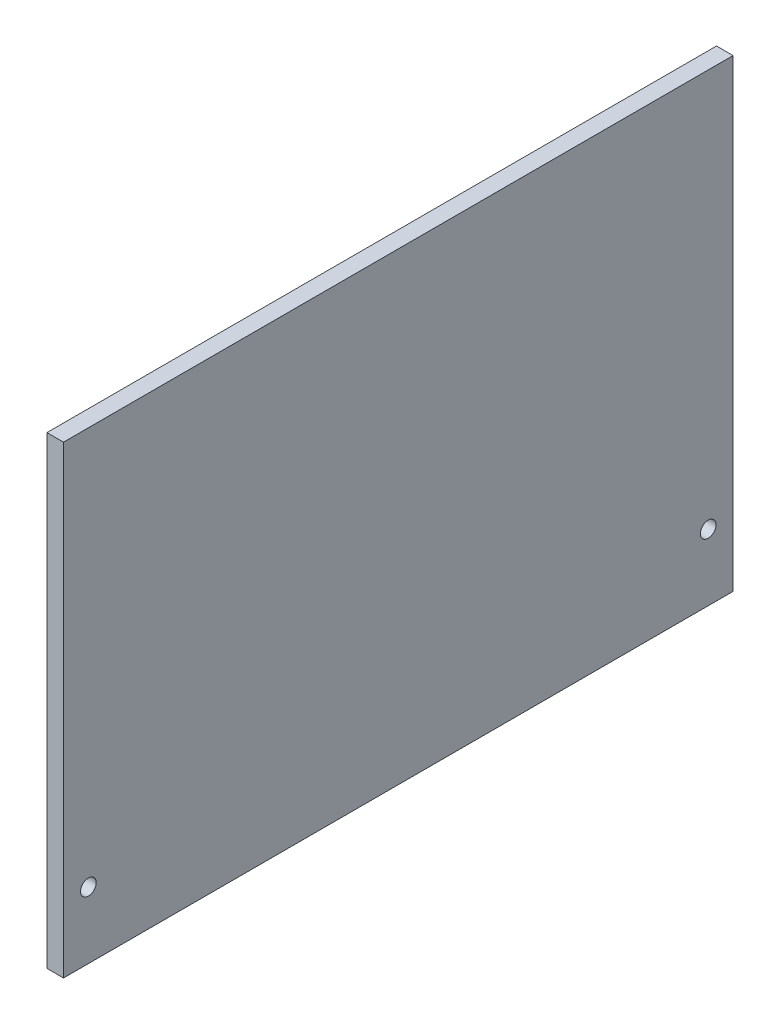
ISO-10303-21;
HEADER;
FILE_DESCRIPTION(('STEP AP214'),'2;1');
FILE_NAME('part.step','',(''),(''),'','','');
FILE_SCHEMA(('AUTOMOTIVE_DESIGN { 1 0 10303 214 1 1 1 1 }'));
ENDSEC;
DATA;
#1=APPLICATION_CONTEXT('core data for automotive mechanical design processes');
#2=APPLICATION_PROTOCOL_DEFINITION('international standard','automotive_design',2000,#1);
#3=PRODUCT_CONTEXT('',#1,'mechanical');
#4=PRODUCT('Part','Part','',(#3));
#5=PRODUCT_RELATED_PRODUCT_CATEGORY('part','',(#4));
#6=PRODUCT_DEFINITION_FORMATION('','',#4);
#7=PRODUCT_DEFINITION_CONTEXT('part definition',#1,'design');
#8=PRODUCT_DEFINITION('design','',#6,#7);
#9=PRODUCT_DEFINITION_SHAPE('','',#8);
#10=(LENGTH_UNIT() NAMED_UNIT(*) SI_UNIT(.MILLI.,.METRE.));
#11=(NAMED_UNIT(*) PLANE_ANGLE_UNIT() SI_UNIT($,.RADIAN.));
#12=(NAMED_UNIT(*) SI_UNIT($,.STERADIAN.) SOLID_ANGLE_UNIT());
#13=UNCERTAINTY_MEASURE_WITH_UNIT(LENGTH_MEASURE(1.E-05),#10,'distance_accuracy_value','');
#14=(GEOMETRIC_REPRESENTATION_CONTEXT(3) GLOBAL_UNCERTAINTY_ASSIGNED_CONTEXT((#13)) GLOBAL_UNIT_ASSIGNED_CONTEXT((#10,
#11,#12)) REPRESENTATION_CONTEXT('',''));
#15=CARTESIAN_POINT('',(0.,0.,0.));
#16=DIRECTION('',(0.,0.,1.));
#17=DIRECTION('',(1.,0.,0.));
#18=AXIS2_PLACEMENT_3D('',#15,#16,#17);
#19=CARTESIAN_POINT('',(3.175,0.,0.));
#20=DIRECTION('',(-1.,0.,0.));
#21=DIRECTION('',(0.,0.,1.));
#22=AXIS2_PLACEMENT_3D('',#19,#20,#21);
#23=PLANE('',#22);
#24=DIRECTION('',(0.,-1.,0.));
#25=VECTOR('',#24,1.);
#26=CARTESIAN_POINT('',(3.175,44.45,64.135));
#27=LINE('',#26,#25);
#28=CARTESIAN_POINT('',(3.175,44.45,64.135));
#29=VERTEX_POINT('',#28);
#30=CARTESIAN_POINT('',(3.175,-44.45,64.135));
#31=VERTEX_POINT('',#30);
#32=EDGE_CURVE('E86',#29,#31,#27,.T.);
#33=ORIENTED_EDGE('',*,*,#32,.T.);
#34=DIRECTION('',(0.,0.,-1.));
#35=VECTOR('',#34,1.);
#36=CARTESIAN_POINT('',(3.175,-44.45,-64.135));
#37=LINE('',#36,#35);
#38=CARTESIAN_POINT('',(3.175,-44.45,-64.135));
#39=VERTEX_POINT('',#38);
#40=EDGE_CURVE('E81',#31,#39,#37,.T.);
#41=ORIENTED_EDGE('',*,*,#40,.T.);
#42=DIRECTION('',(0.,1.,0.));
#43=VECTOR('',#42,1.);
#44=CARTESIAN_POINT('',(3.175,44.45,-64.135));
#45=LINE('',#44,#43);
#46=CARTESIAN_POINT('',(3.175,44.45,-64.135));
#47=VERTEX_POINT('',#46);
#48=EDGE_CURVE('E84',#39,#47,#45,.T.);
#49=ORIENTED_EDGE('',*,*,#48,.T.);
#50=DIRECTION('',(0.,0.,1.));
#51=VECTOR('',#50,1.);
#52=CARTESIAN_POINT('',(3.175,44.45,-64.135));
#53=LINE('',#52,#51);
#54=EDGE_CURVE('E51',#47,#29,#53,.T.);
#55=ORIENTED_EDGE('',*,*,#54,.T.);
#56=EDGE_LOOP('',(#33,#41,#49,#55));
#57=FACE_BOUND('',#56,.T.);
#58=CARTESIAN_POINT('',(3.175,-31.75,59.3725));
#59=DIRECTION('',(1.,0.,0.));
#60=DIRECTION('',(0.,0.,-1.));
#61=AXIS2_PLACEMENT_3D('',#58,#59,#60);
#62=CIRCLE('',#61,1.5);
#63=CARTESIAN_POINT('',(3.175,-31.75,57.8725));
#64=VERTEX_POINT('',#63);
#65=EDGE_CURVE('E101',#64,#64,#62,.T.);
#66=ORIENTED_EDGE('',*,*,#65,.F.);
#67=EDGE_LOOP('',(#66));
#68=FACE_BOUND('',#67,.T.);
#69=CARTESIAN_POINT('',(3.175,-31.75,-59.3725));
#70=DIRECTION('',(1.,0.,0.));
#71=DIRECTION('',(0.,0.,-1.));
#72=AXIS2_PLACEMENT_3D('',#69,#70,#71);
#73=CIRCLE('',#72,1.5);
#74=CARTESIAN_POINT('',(3.175,-31.75,-60.8725));
#75=VERTEX_POINT('',#74);
#76=EDGE_CURVE('E116',#75,#75,#73,.T.);
#77=ORIENTED_EDGE('',*,*,#76,.F.);
#78=EDGE_LOOP('',(#77));
#79=FACE_BOUND('',#78,.T.);
#80=ADVANCED_FACE('F34',(#57,#68,#79),#23,.F.);
#81=CARTESIAN_POINT('',(0.,0.,0.));
#82=DIRECTION('',(-1.,0.,0.));
#83=DIRECTION('',(0.,0.,1.));
#84=AXIS2_PLACEMENT_3D('',#81,#82,#83);
#85=PLANE('',#84);
#86=CARTESIAN_POINT('',(0.,-31.75,59.3725));
#87=DIRECTION('',(1.,0.,0.));
#88=DIRECTION('',(0.,0.,-1.));
#89=AXIS2_PLACEMENT_3D('',#86,#87,#88);
#90=CIRCLE('',#89,1.5);
#91=CARTESIAN_POINT('',(0.,-31.75,57.8725));
#92=VERTEX_POINT('',#91);
#93=EDGE_CURVE('E113',#92,#92,#90,.T.);
#94=ORIENTED_EDGE('',*,*,#93,.T.);
#95=EDGE_LOOP('',(#94));
#96=FACE_BOUND('',#95,.T.);
#97=DIRECTION('',(0.,-1.,0.));
#98=VECTOR('',#97,1.);
#99=CARTESIAN_POINT('',(0.,44.45,64.135));
#100=LINE('',#99,#98);
#101=CARTESIAN_POINT('',(0.,44.45,64.135));
#102=VERTEX_POINT('',#101);
#103=CARTESIAN_POINT('',(0.,-44.45,64.135));
#104=VERTEX_POINT('',#103);
#105=EDGE_CURVE('E98',#102,#104,#100,.T.);
#106=ORIENTED_EDGE('',*,*,#105,.F.);
#107=DIRECTION('',(0.,0.,1.));
#108=VECTOR('',#107,1.);
#109=CARTESIAN_POINT('',(0.,44.45,-64.135));
#110=LINE('',#109,#108);
#111=CARTESIAN_POINT('',(0.,44.45,-64.135));
#112=VERTEX_POINT('',#111);
#113=EDGE_CURVE('E74',#112,#102,#110,.T.);
#114=ORIENTED_EDGE('',*,*,#113,.F.);
#115=DIRECTION('',(0.,1.,0.));
#116=VECTOR('',#115,1.);
#117=CARTESIAN_POINT('',(0.,44.45,-64.135));
#118=LINE('',#117,#116);
#119=CARTESIAN_POINT('',(0.,-44.45,-64.135));
#120=VERTEX_POINT('',#119);
#121=EDGE_CURVE('E68',#120,#112,#118,.T.);
#122=ORIENTED_EDGE('',*,*,#121,.F.);
#123=DIRECTION('',(0.,0.,-1.));
#124=VECTOR('',#123,1.);
#125=CARTESIAN_POINT('',(0.,-44.45,-64.135));
#126=LINE('',#125,#124);
#127=EDGE_CURVE('E90',#104,#120,#126,.T.);
#128=ORIENTED_EDGE('',*,*,#127,.F.);
#129=EDGE_LOOP('',(#106,#114,#122,#128));
#130=FACE_BOUND('',#129,.T.);
#131=CARTESIAN_POINT('',(0.,-31.75,-59.3725));
#132=DIRECTION('',(1.,0.,0.));
#133=DIRECTION('',(0.,0.,-1.));
#134=AXIS2_PLACEMENT_3D('',#131,#132,#133);
#135=CIRCLE('',#134,1.5);
#136=CARTESIAN_POINT('',(0.,-31.75,-60.8725));
#137=VERTEX_POINT('',#136);
#138=EDGE_CURVE('E119',#137,#137,#135,.T.);
#139=ORIENTED_EDGE('',*,*,#138,.T.);
#140=EDGE_LOOP('',(#139));
#141=FACE_BOUND('',#140,.T.);
#142=ADVANCED_FACE('F109',(#96,#130,#141),#85,.T.);
#143=CARTESIAN_POINT('',(3.175,44.45,64.135));
#144=DIRECTION('',(0.,0.,-1.));
#145=DIRECTION('',(0.,1.,0.));
#146=AXIS2_PLACEMENT_3D('',#143,#144,#145);
#147=PLANE('',#146);
#148=ORIENTED_EDGE('',*,*,#105,.T.);
#149=DIRECTION('',(-1.,0.,0.));
#150=VECTOR('',#149,1.);
#151=CARTESIAN_POINT('',(3.175,-44.45,64.135));
#152=LINE('',#151,#150);
#153=EDGE_CURVE('E11',#31,#104,#152,.T.);
#154=ORIENTED_EDGE('',*,*,#153,.F.);
#155=ORIENTED_EDGE('',*,*,#32,.F.);
#156=DIRECTION('',(-1.,0.,0.));
#157=VECTOR('',#156,1.);
#158=CARTESIAN_POINT('',(3.175,44.45,64.135));
#159=LINE('',#158,#157);
#160=EDGE_CURVE('E94',#29,#102,#159,.T.);
#161=ORIENTED_EDGE('',*,*,#160,.T.);
#162=EDGE_LOOP('',(#148,#154,#155,#161));
#163=FACE_BOUND('',#162,.T.);
#164=ADVANCED_FACE('F36',(#163),#147,.F.);
#165=CARTESIAN_POINT('',(3.175,-44.45,-64.135));
#166=DIRECTION('',(0.,1.,0.));
#167=DIRECTION('',(0.,0.,1.));
#168=AXIS2_PLACEMENT_3D('',#165,#166,#167);
#169=PLANE('',#168);
#170=ORIENTED_EDGE('',*,*,#127,.T.);
#171=DIRECTION('',(-1.,0.,0.));
#172=VECTOR('',#171,1.);
#173=CARTESIAN_POINT('',(3.175,-44.45,-64.135));
#174=LINE('',#173,#172);
#175=EDGE_CURVE('E43',#39,#120,#174,.T.);
#176=ORIENTED_EDGE('',*,*,#175,.F.);
#177=ORIENTED_EDGE('',*,*,#40,.F.);
#178=ORIENTED_EDGE('',*,*,#153,.T.);
#179=EDGE_LOOP('',(#170,#176,#177,#178));
#180=FACE_BOUND('',#179,.T.);
#181=ADVANCED_FACE('F89',(#180),#169,.F.);
#182=CARTESIAN_POINT('',(3.175,44.45,-64.135));
#183=DIRECTION('',(0.,0.,1.));
#184=DIRECTION('',(1.,0.,0.));
#185=AXIS2_PLACEMENT_3D('',#182,#183,#184);
#186=PLANE('',#185);
#187=ORIENTED_EDGE('',*,*,#121,.T.);
#188=DIRECTION('',(-1.,0.,0.));
#189=VECTOR('',#188,1.);
#190=CARTESIAN_POINT('',(3.175,44.45,-64.135));
#191=LINE('',#190,#189);
#192=EDGE_CURVE('E91',#47,#112,#191,.T.);
#193=ORIENTED_EDGE('',*,*,#192,.F.);
#194=ORIENTED_EDGE('',*,*,#48,.F.);
#195=ORIENTED_EDGE('',*,*,#175,.T.);
#196=EDGE_LOOP('',(#187,#193,#194,#195));
#197=FACE_BOUND('',#196,.T.);
#198=ADVANCED_FACE('F92',(#197),#186,.F.);
#199=CARTESIAN_POINT('',(3.175,44.45,-64.135));
#200=DIRECTION('',(0.,-1.,0.));
#201=DIRECTION('',(0.,0.,-1.));
#202=AXIS2_PLACEMENT_3D('',#199,#200,#201);
#203=PLANE('',#202);
#204=ORIENTED_EDGE('',*,*,#113,.T.);
#205=ORIENTED_EDGE('',*,*,#160,.F.);
#206=ORIENTED_EDGE('',*,*,#54,.F.);
#207=ORIENTED_EDGE('',*,*,#192,.T.);
#208=EDGE_LOOP('',(#204,#205,#206,#207));
#209=FACE_BOUND('',#208,.T.);
#210=ADVANCED_FACE('F106',(#209),#203,.F.);
#211=CARTESIAN_POINT('',(3.175,-31.75,59.3725));
#212=DIRECTION('',(-1.,0.,0.));
#213=DIRECTION('',(0.,0.,1.));
#214=AXIS2_PLACEMENT_3D('',#211,#212,#213);
#215=CYLINDRICAL_SURFACE('',#214,1.5);
#216=ORIENTED_EDGE('',*,*,#65,.T.);
#217=EDGE_LOOP('',(#216));
#218=FACE_BOUND('',#217,.T.);
#219=ORIENTED_EDGE('',*,*,#93,.F.);
#220=EDGE_LOOP('',(#219));
#221=FACE_BOUND('',#220,.T.);
#222=ADVANCED_FACE('F136',(#218,#221),#215,.F.);
#223=CARTESIAN_POINT('',(3.175,-31.75,-59.3725));
#224=DIRECTION('',(-1.,0.,0.));
#225=DIRECTION('',(0.,0.,1.));
#226=AXIS2_PLACEMENT_3D('',#223,#224,#225);
#227=CYLINDRICAL_SURFACE('',#226,1.5);
#228=ORIENTED_EDGE('',*,*,#76,.T.);
#229=EDGE_LOOP('',(#228));
#230=FACE_BOUND('',#229,.T.);
#231=ORIENTED_EDGE('',*,*,#138,.F.);
#232=EDGE_LOOP('',(#231));
#233=FACE_BOUND('',#232,.T.);
#234=ADVANCED_FACE('F125',(#230,#233),#227,.F.);
#235=CLOSED_SHELL('',(#80,#142,#164,#181,#198,#210,#222,#234));
#236=MANIFOLD_SOLID_BREP('B2',#235);
#237=ADVANCED_BREP_SHAPE_REPRESENTATION('',(#18,#236),#14);
#238=SHAPE_DEFINITION_REPRESENTATION(#9,#237);
ENDSEC;
END-ISO-10303-21;
